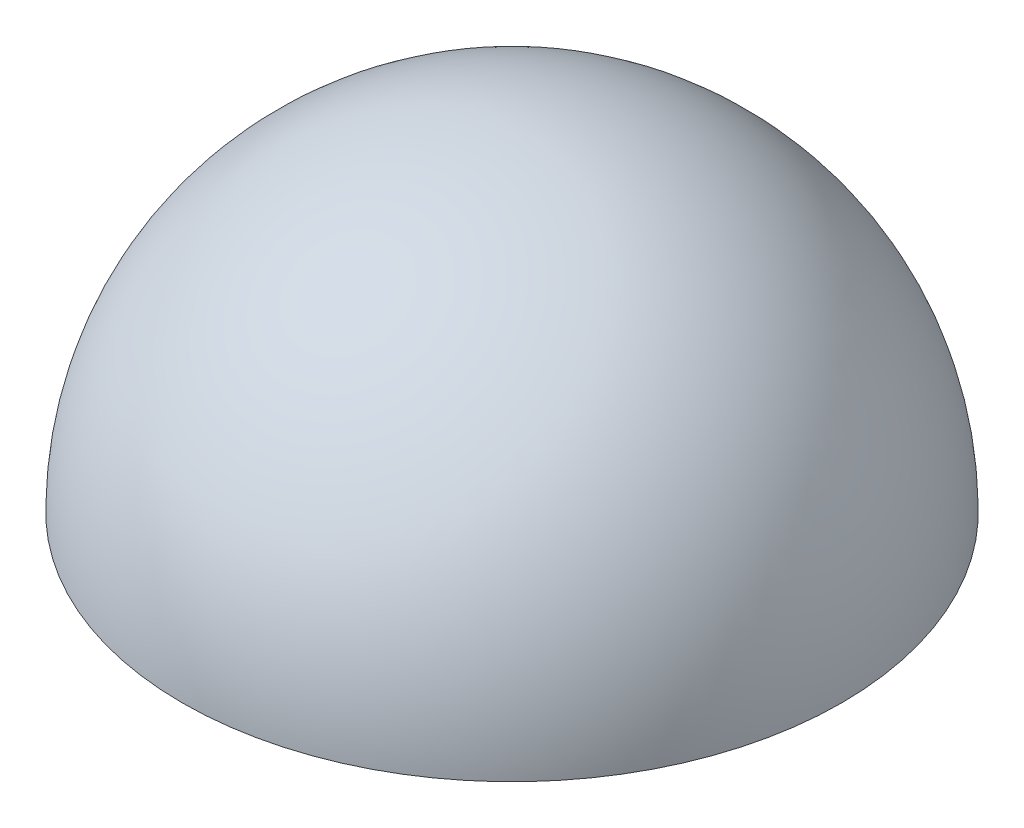
ISO-10303-21;
HEADER;
FILE_DESCRIPTION(('STEP AP214'),'2;1');
FILE_NAME('part.step','',(''),(''),'','','');
FILE_SCHEMA(('AUTOMOTIVE_DESIGN { 1 0 10303 214 1 1 1 1 }'));
ENDSEC;
DATA;
#1=APPLICATION_CONTEXT('core data for automotive mechanical design processes');
#2=APPLICATION_PROTOCOL_DEFINITION('international standard','automotive_design',2000,#1);
#3=PRODUCT_CONTEXT('',#1,'mechanical');
#4=PRODUCT('Part','Part','',(#3));
#5=PRODUCT_RELATED_PRODUCT_CATEGORY('part','',(#4));
#6=PRODUCT_DEFINITION_FORMATION('','',#4);
#7=PRODUCT_DEFINITION_CONTEXT('part definition',#1,'design');
#8=PRODUCT_DEFINITION('design','',#6,#7);
#9=PRODUCT_DEFINITION_SHAPE('','',#8);
#10=(LENGTH_UNIT() NAMED_UNIT(*) SI_UNIT(.MILLI.,.METRE.));
#11=(NAMED_UNIT(*) PLANE_ANGLE_UNIT() SI_UNIT($,.RADIAN.));
#12=(NAMED_UNIT(*) SI_UNIT($,.STERADIAN.) SOLID_ANGLE_UNIT());
#13=UNCERTAINTY_MEASURE_WITH_UNIT(LENGTH_MEASURE(1.E-05),#10,'distance_accuracy_value','');
#14=(GEOMETRIC_REPRESENTATION_CONTEXT(3) GLOBAL_UNCERTAINTY_ASSIGNED_CONTEXT((#13)) GLOBAL_UNIT_ASSIGNED_CONTEXT((#10,
#11,#12)) REPRESENTATION_CONTEXT('',''));
#15=CARTESIAN_POINT('',(0.,0.,0.));
#16=DIRECTION('',(0.,0.,1.));
#17=DIRECTION('',(1.,0.,0.));
#18=AXIS2_PLACEMENT_3D('',#15,#16,#17);
#19=CARTESIAN_POINT('',(0.,0.,0.));
#20=DIRECTION('',(0.,1.,0.));
#21=DIRECTION('',(0.,0.,1.));
#22=AXIS2_PLACEMENT_3D('',#19,#20,#21);
#23=PLANE('',#22);
#24=CARTESIAN_POINT('',(0.,0.,0.));
#25=DIRECTION('',(0.,1.,0.));
#26=DIRECTION('',(0.,0.,1.));
#27=AXIS2_PLACEMENT_3D('',#24,#25,#26);
#28=CIRCLE('',#27,20.);
#29=CARTESIAN_POINT('',(0.,0.,20.));
#30=VERTEX_POINT('',#29);
#31=EDGE_CURVE('E10',#30,#30,#28,.T.);
#32=ORIENTED_EDGE('',*,*,#31,.F.);
#33=EDGE_LOOP('',(#32));
#34=FACE_BOUND('',#33,.T.);
#35=ADVANCED_FACE('F37',(#34),#23,.F.);
#36=CARTESIAN_POINT('',(0.,0.,0.));
#37=DIRECTION('',(0.,1.,0.));
#38=DIRECTION('',(1.,0.,0.));
#39=AXIS2_PLACEMENT_3D('',#36,#37,#38);
#40=SPHERICAL_SURFACE('',#39,20.);
#41=ORIENTED_EDGE('',*,*,#31,.T.);
#42=EDGE_LOOP('',(#41));
#43=FACE_BOUND('',#42,.T.);
#44=ADVANCED_FACE('F45',(#43),#40,.T.);
#45=CLOSED_SHELL('',(#35,#44));
#46=MANIFOLD_SOLID_BREP('B2',#45);
#47=ADVANCED_BREP_SHAPE_REPRESENTATION('',(#18,#46),#14);
#48=SHAPE_DEFINITION_REPRESENTATION(#9,#47);
ENDSEC;
END-ISO-10303-21;
